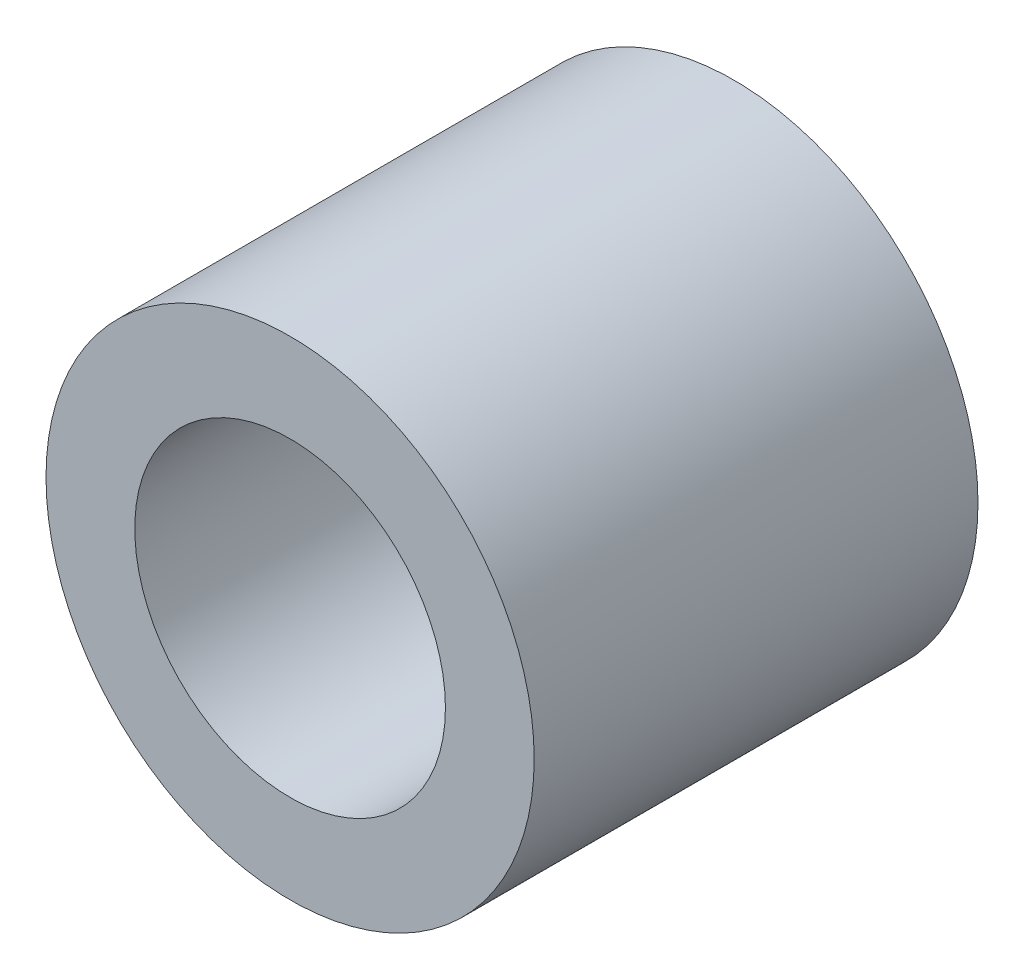
ISO-10303-21;
HEADER;
FILE_DESCRIPTION(('STEP AP214'),'2;1');
FILE_NAME('part.step','',(''),(''),'','','');
FILE_SCHEMA(('AUTOMOTIVE_DESIGN { 1 0 10303 214 1 1 1 1 }'));
ENDSEC;
DATA;
#1=APPLICATION_CONTEXT('core data for automotive mechanical design processes');
#2=APPLICATION_PROTOCOL_DEFINITION('international standard','automotive_design',2000,#1);
#3=PRODUCT_CONTEXT('',#1,'mechanical');
#4=PRODUCT('Part','Part','',(#3));
#5=PRODUCT_RELATED_PRODUCT_CATEGORY('part','',(#4));
#6=PRODUCT_DEFINITION_FORMATION('','',#4);
#7=PRODUCT_DEFINITION_CONTEXT('part definition',#1,'design');
#8=PRODUCT_DEFINITION('design','',#6,#7);
#9=PRODUCT_DEFINITION_SHAPE('','',#8);
#10=(LENGTH_UNIT() NAMED_UNIT(*) SI_UNIT(.MILLI.,.METRE.));
#11=(NAMED_UNIT(*) PLANE_ANGLE_UNIT() SI_UNIT($,.RADIAN.));
#12=(NAMED_UNIT(*) SI_UNIT($,.STERADIAN.) SOLID_ANGLE_UNIT());
#13=UNCERTAINTY_MEASURE_WITH_UNIT(LENGTH_MEASURE(1.E-05),#10,'distance_accuracy_value','');
#14=(GEOMETRIC_REPRESENTATION_CONTEXT(3) GLOBAL_UNCERTAINTY_ASSIGNED_CONTEXT((#13)) GLOBAL_UNIT_ASSIGNED_CONTEXT((#10,
#11,#12)) REPRESENTATION_CONTEXT('',''));
#15=CARTESIAN_POINT('',(0.,0.,0.));
#16=DIRECTION('',(0.,0.,1.));
#17=DIRECTION('',(1.,0.,0.));
#18=AXIS2_PLACEMENT_3D('',#15,#16,#17);
#19=CARTESIAN_POINT('',(0.,0.,5.));
#20=DIRECTION('',(0.,0.,1.));
#21=DIRECTION('',(1.,0.,0.));
#22=AXIS2_PLACEMENT_3D('',#19,#20,#21);
#23=PLANE('',#22);
#24=CARTESIAN_POINT('',(0.,0.,5.));
#25=DIRECTION('',(0.,0.,1.));
#26=DIRECTION('',(1.,0.,0.));
#27=AXIS2_PLACEMENT_3D('',#24,#25,#26);
#28=CIRCLE('',#27,2.75);
#29=CARTESIAN_POINT('',(2.75,0.,5.));
#30=VERTEX_POINT('',#29);
#31=EDGE_CURVE('E10',#30,#30,#28,.T.);
#32=ORIENTED_EDGE('',*,*,#31,.T.);
#33=EDGE_LOOP('',(#32));
#34=FACE_BOUND('',#33,.T.);
#35=CARTESIAN_POINT('',(0.,0.,5.));
#36=DIRECTION('',(0.,0.,1.));
#37=DIRECTION('',(1.,0.,0.));
#38=AXIS2_PLACEMENT_3D('',#35,#36,#37);
#39=CIRCLE('',#38,1.75);
#40=CARTESIAN_POINT('',(1.75,0.,5.));
#41=VERTEX_POINT('',#40);
#42=EDGE_CURVE('E50',#41,#41,#39,.T.);
#43=ORIENTED_EDGE('',*,*,#42,.F.);
#44=EDGE_LOOP('',(#43));
#45=FACE_BOUND('',#44,.T.);
#46=ADVANCED_FACE('F37',(#34,#45),#23,.T.);
#47=CARTESIAN_POINT('',(0.,0.,0.));
#48=DIRECTION('',(0.,0.,1.));
#49=DIRECTION('',(1.,0.,0.));
#50=AXIS2_PLACEMENT_3D('',#47,#48,#49);
#51=PLANE('',#50);
#52=CARTESIAN_POINT('',(0.,0.,0.));
#53=DIRECTION('',(0.,0.,1.));
#54=DIRECTION('',(1.,0.,0.));
#55=AXIS2_PLACEMENT_3D('',#52,#53,#54);
#56=CIRCLE('',#55,2.75);
#57=CARTESIAN_POINT('',(2.75,0.,0.));
#58=VERTEX_POINT('',#57);
#59=EDGE_CURVE('E41',#58,#58,#56,.T.);
#60=ORIENTED_EDGE('',*,*,#59,.F.);
#61=EDGE_LOOP('',(#60));
#62=FACE_BOUND('',#61,.T.);
#63=CARTESIAN_POINT('',(0.,0.,0.));
#64=DIRECTION('',(0.,0.,1.));
#65=DIRECTION('',(1.,0.,0.));
#66=AXIS2_PLACEMENT_3D('',#63,#64,#65);
#67=CIRCLE('',#66,1.75);
#68=CARTESIAN_POINT('',(1.75,0.,0.));
#69=VERTEX_POINT('',#68);
#70=EDGE_CURVE('E52',#69,#69,#67,.T.);
#71=ORIENTED_EDGE('',*,*,#70,.T.);
#72=EDGE_LOOP('',(#71));
#73=FACE_BOUND('',#72,.T.);
#74=ADVANCED_FACE('F64',(#62,#73),#51,.F.);
#75=CARTESIAN_POINT('',(0.,0.,5.));
#76=DIRECTION('',(0.,0.,-1.));
#77=DIRECTION('',(-1.,0.,0.));
#78=AXIS2_PLACEMENT_3D('',#75,#76,#77);
#79=CYLINDRICAL_SURFACE('',#78,2.75);
#80=ORIENTED_EDGE('',*,*,#31,.F.);
#81=EDGE_LOOP('',(#80));
#82=FACE_BOUND('',#81,.T.);
#83=ORIENTED_EDGE('',*,*,#59,.T.);
#84=EDGE_LOOP('',(#83));
#85=FACE_BOUND('',#84,.T.);
#86=ADVANCED_FACE('F39',(#82,#85),#79,.T.);
#87=CARTESIAN_POINT('',(0.,0.,5.));
#88=DIRECTION('',(0.,0.,-1.));
#89=DIRECTION('',(-1.,0.,0.));
#90=AXIS2_PLACEMENT_3D('',#87,#88,#89);
#91=CYLINDRICAL_SURFACE('',#90,1.75);
#92=ORIENTED_EDGE('',*,*,#42,.T.);
#93=EDGE_LOOP('',(#92));
#94=FACE_BOUND('',#93,.T.);
#95=ORIENTED_EDGE('',*,*,#70,.F.);
#96=EDGE_LOOP('',(#95));
#97=FACE_BOUND('',#96,.T.);
#98=ADVANCED_FACE('F60',(#94,#97),#91,.F.);
#99=CLOSED_SHELL('',(#46,#74,#86,#98));
#100=MANIFOLD_SOLID_BREP('B2',#99);
#101=ADVANCED_BREP_SHAPE_REPRESENTATION('',(#18,#100),#14);
#102=SHAPE_DEFINITION_REPRESENTATION(#9,#101);
ENDSEC;
END-ISO-10303-21;
